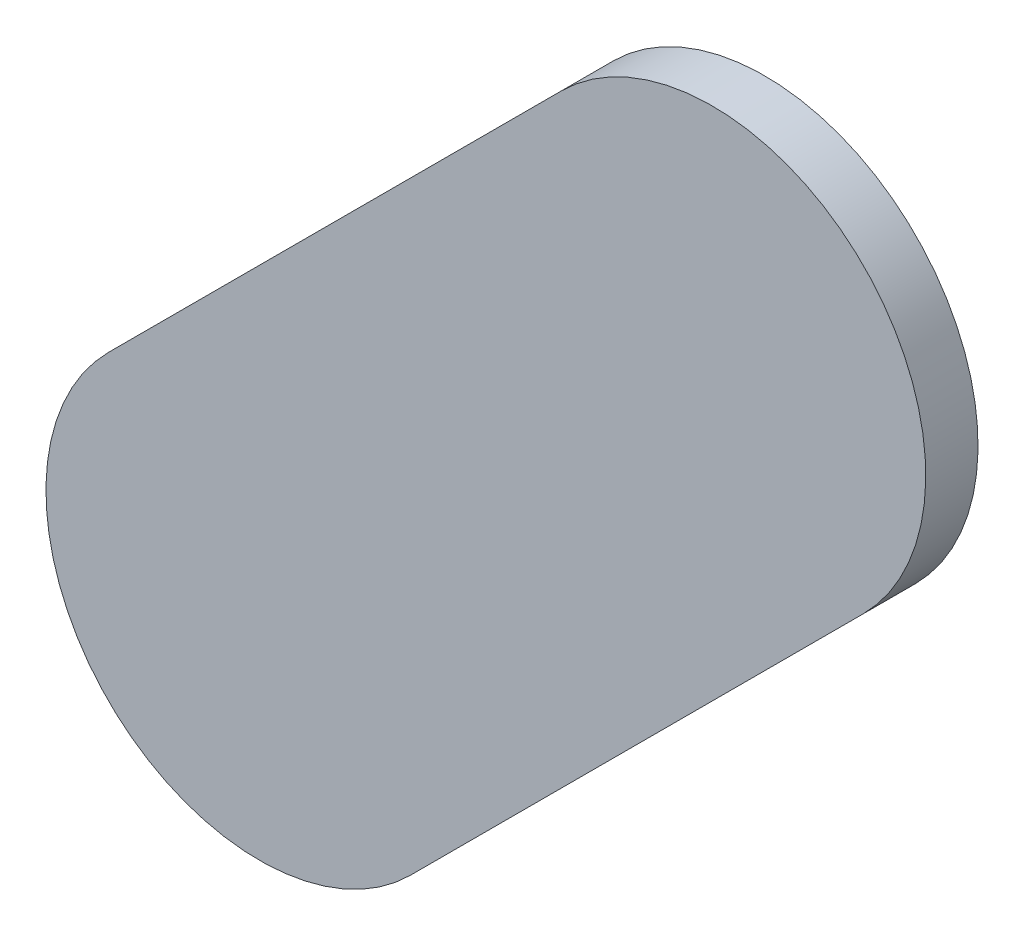
ISO-10303-21;
HEADER;
FILE_DESCRIPTION(('STEP AP214'),'2;1');
FILE_NAME('part.step','',(''),(''),'','','');
FILE_SCHEMA(('AUTOMOTIVE_DESIGN { 1 0 10303 214 1 1 1 1 }'));
ENDSEC;
DATA;
#1=APPLICATION_CONTEXT('core data for automotive mechanical design processes');
#2=APPLICATION_PROTOCOL_DEFINITION('international standard','automotive_design',2000,#1);
#3=PRODUCT_CONTEXT('',#1,'mechanical');
#4=PRODUCT('Part','Part','',(#3));
#5=PRODUCT_RELATED_PRODUCT_CATEGORY('part','',(#4));
#6=PRODUCT_DEFINITION_FORMATION('','',#4);
#7=PRODUCT_DEFINITION_CONTEXT('part definition',#1,'design');
#8=PRODUCT_DEFINITION('design','',#6,#7);
#9=PRODUCT_DEFINITION_SHAPE('','',#8);
#10=(LENGTH_UNIT() NAMED_UNIT(*) SI_UNIT(.MILLI.,.METRE.));
#11=(NAMED_UNIT(*) PLANE_ANGLE_UNIT() SI_UNIT($,.RADIAN.));
#12=(NAMED_UNIT(*) SI_UNIT($,.STERADIAN.) SOLID_ANGLE_UNIT());
#13=UNCERTAINTY_MEASURE_WITH_UNIT(LENGTH_MEASURE(1.E-05),#10,'distance_accuracy_value','');
#14=(GEOMETRIC_REPRESENTATION_CONTEXT(3) GLOBAL_UNCERTAINTY_ASSIGNED_CONTEXT((#13)) GLOBAL_UNIT_ASSIGNED_CONTEXT((#10,
#11,#12)) REPRESENTATION_CONTEXT('',''));
#15=CARTESIAN_POINT('',(0.,0.,0.));
#16=DIRECTION('',(0.,0.,1.));
#17=DIRECTION('',(1.,0.,0.));
#18=AXIS2_PLACEMENT_3D('',#15,#16,#17);
#19=CARTESIAN_POINT('',(5.77664475598,8.031518644531,0.79916));
#20=DIRECTION('',(0.,0.,1.));
#21=DIRECTION('',(1.,0.,0.));
#22=AXIS2_PLACEMENT_3D('',#19,#20,#21);
#23=PLANE('',#22);
#24=CARTESIAN_POINT('',(5.628152,7.883026,0.79916));
#25=DIRECTION('',(0.,0.,1.));
#26=DIRECTION('',(1.,0.,0.));
#27=AXIS2_PLACEMENT_3D('',#24,#25,#26);
#28=CIRCLE('',#27,0.139999667);
#29=CARTESIAN_POINT('',(5.72714731612217,7.78403131612202,0.79916));
#30=VERTEX_POINT('',#29);
#31=CARTESIAN_POINT('',(5.52915740491727,7.98202083271486,0.79916));
#32=VERTEX_POINT('',#31);
#33=EDGE_CURVE('E20',#30,#32,#28,.F.);
#34=ORIENTED_EDGE('',*,*,#33,.F.);
#35=DIRECTION('',(-0.707106660628037,-0.707106901745037,0.));
#36=VECTOR('',#35,1.);
#37=CARTESIAN_POINT('',(6.024131949366,8.081016050635,0.79916));
#38=LINE('',#37,#36);
#39=CARTESIAN_POINT('',(6.02413212430482,8.08101622557388,0.79916));
#40=VERTEX_POINT('',#39);
#41=EDGE_CURVE('E65',#30,#40,#38,.F.);
#42=ORIENTED_EDGE('',*,*,#41,.T.);
#43=CARTESIAN_POINT('',(5.925137,8.180011101268,0.79916));
#44=DIRECTION('',(0.,0.,1.));
#45=DIRECTION('',(1.,0.,0.));
#46=AXIS2_PLACEMENT_3D('',#43,#44,#45);
#47=CIRCLE('',#46,0.14);
#48=CARTESIAN_POINT('',(5.82614197763338,8.27900597763353,0.79916));
#49=VERTEX_POINT('',#48);
#50=EDGE_CURVE('E57',#49,#40,#47,.F.);
#51=ORIENTED_EDGE('',*,*,#50,.F.);
#52=DIRECTION('',(0.707106099992719,0.707107462379719,0.));
#53=VECTOR('',#52,1.);
#54=CARTESIAN_POINT('',(5.5291576191,7.982021046898,0.79916));
#55=LINE('',#54,#53);
#56=EDGE_CURVE('E64',#49,#32,#55,.F.);
#57=ORIENTED_EDGE('',*,*,#56,.T.);
#58=EDGE_LOOP('',(#34,#42,#51,#57));
#59=FACE_BOUND('',#58,.T.);
#60=ADVANCED_FACE('F17',(#59),#23,.T.);
#61=CARTESIAN_POINT('',(6.024131949366,8.081016050635,0.76487));
#62=DIRECTION('',(-0.707106901745037,0.707106660628037,0.));
#63=DIRECTION('',(-0.707106660628037,-0.707106901745037,0.));
#64=AXIS2_PLACEMENT_3D('',#61,#62,#63);
#65=PLANE('',#64);
#66=DIRECTION('',(0.,0.,1.));
#67=VECTOR('',#66,1.);
#68=CARTESIAN_POINT('',(5.7271473330001,7.7840313329999,0.76487));
#69=LINE('',#68,#67);
#70=CARTESIAN_POINT('',(5.72714731612214,7.78403131612203,0.76487));
#71=VERTEX_POINT('',#70);
#72=EDGE_CURVE('E68',#71,#30,#69,.T.);
#73=ORIENTED_EDGE('',*,*,#72,.F.);
#74=DIRECTION('',(-0.707106660628131,-0.707106901744943,0.));
#75=VECTOR('',#74,1.);
#76=CARTESIAN_POINT('',(6.024131949366,8.081016050635,0.76487));
#77=LINE('',#76,#75);
#78=CARTESIAN_POINT('',(6.02413212430481,8.08101622557387,0.76487));
#79=VERTEX_POINT('',#78);
#80=EDGE_CURVE('E72',#79,#71,#77,.T.);
#81=ORIENTED_EDGE('',*,*,#80,.F.);
#82=DIRECTION('',(0.,0.,1.));
#83=VECTOR('',#82,1.);
#84=CARTESIAN_POINT('',(6.024131949366,8.081016050635,0.76487));
#85=LINE('',#84,#83);
#86=EDGE_CURVE('E60',#40,#79,#85,.F.);
#87=ORIENTED_EDGE('',*,*,#86,.F.);
#88=ORIENTED_EDGE('',*,*,#41,.F.);
#89=EDGE_LOOP('',(#73,#81,#87,#88));
#90=FACE_BOUND('',#89,.T.);
#91=ADVANCED_FACE('F70',(#90),#65,.F.);
#92=CARTESIAN_POINT('',(5.628152,7.883026,0.76487));
#93=DIRECTION('',(0.,0.,1.));
#94=DIRECTION('',(1.,0.,0.));
#95=AXIS2_PLACEMENT_3D('',#92,#93,#94);
#96=CYLINDRICAL_SURFACE('',#95,0.139999667);
#97=DIRECTION('',(0.,0.,1.));
#98=VECTOR('',#97,1.);
#99=CARTESIAN_POINT('',(5.5291576191,7.982021046898,0.76487));
#100=LINE('',#99,#98);
#101=CARTESIAN_POINT('',(5.52915740491729,7.98202083271488,0.76487));
#102=VERTEX_POINT('',#101);
#103=EDGE_CURVE('E77',#32,#102,#100,.F.);
#104=ORIENTED_EDGE('',*,*,#103,.T.);
#105=CARTESIAN_POINT('',(5.628152333,7.883026231732,0.76487));
#106=DIRECTION('',(0.,0.,1.));
#107=DIRECTION('',(1.,0.,0.));
#108=AXIS2_PLACEMENT_3D('',#105,#106,#107);
#109=CIRCLE('',#108,0.14);
#110=EDGE_CURVE('E26',#71,#102,#109,.F.);
#111=ORIENTED_EDGE('',*,*,#110,.F.);
#112=ORIENTED_EDGE('',*,*,#72,.T.);
#113=ORIENTED_EDGE('',*,*,#33,.T.);
#114=EDGE_LOOP('',(#104,#111,#112,#113));
#115=FACE_BOUND('',#114,.T.);
#116=ADVANCED_FACE('F88',(#115),#96,.T.);
#117=CARTESIAN_POINT('',(5.5291576191,7.982021046898,0.76487));
#118=DIRECTION('',(0.707107462379719,-0.707106099992719,0.));
#119=DIRECTION('',(0.707106099992719,0.707107462379719,0.));
#120=AXIS2_PLACEMENT_3D('',#117,#118,#119);
#121=PLANE('',#120);
#122=DIRECTION('',(0.,0.,1.));
#123=VECTOR('',#122,1.);
#124=CARTESIAN_POINT('',(5.8261419999999,8.2790060000001,0.76487));
#125=LINE('',#124,#123);
#126=CARTESIAN_POINT('',(5.82614197763344,8.2790059776335,0.76487));
#127=VERTEX_POINT('',#126);
#128=EDGE_CURVE('E62',#127,#49,#125,.T.);
#129=ORIENTED_EDGE('',*,*,#128,.F.);
#130=DIRECTION('',(0.707106099992947,0.707107462379492,0.));
#131=VECTOR('',#130,1.);
#132=CARTESIAN_POINT('',(5.5291576191,7.982021046898,0.76487));
#133=LINE('',#132,#131);
#134=EDGE_CURVE('E11',#102,#127,#133,.T.);
#135=ORIENTED_EDGE('',*,*,#134,.F.);
#136=ORIENTED_EDGE('',*,*,#103,.F.);
#137=ORIENTED_EDGE('',*,*,#56,.F.);
#138=EDGE_LOOP('',(#129,#135,#136,#137));
#139=FACE_BOUND('',#138,.T.);
#140=ADVANCED_FACE('F96',(#139),#121,.F.);
#141=CARTESIAN_POINT('',(5.925137,8.180011101268,0.76487));
#142=DIRECTION('',(0.,0.,1.));
#143=DIRECTION('',(1.,0.,0.));
#144=AXIS2_PLACEMENT_3D('',#141,#142,#143);
#145=CYLINDRICAL_SURFACE('',#144,0.14);
#146=CARTESIAN_POINT('',(5.925137333,8.180011333,0.76487));
#147=DIRECTION('',(0.,0.,1.));
#148=DIRECTION('',(1.,0.,0.));
#149=AXIS2_PLACEMENT_3D('',#146,#147,#148);
#150=CIRCLE('',#149,0.14);
#151=EDGE_CURVE('E35',#127,#79,#150,.F.);
#152=ORIENTED_EDGE('',*,*,#151,.F.);
#153=ORIENTED_EDGE('',*,*,#128,.T.);
#154=ORIENTED_EDGE('',*,*,#50,.T.);
#155=ORIENTED_EDGE('',*,*,#86,.T.);
#156=EDGE_LOOP('',(#152,#153,#154,#155));
#157=FACE_BOUND('',#156,.T.);
#158=ADVANCED_FACE('F58',(#157),#145,.T.);
#159=CARTESIAN_POINT('',(5.77664475598,8.031518644531,0.76487));
#160=DIRECTION('',(0.,0.,-1.));
#161=DIRECTION('',(-1.,0.,0.));
#162=AXIS2_PLACEMENT_3D('',#159,#160,#161);
#163=PLANE('',#162);
#164=ORIENTED_EDGE('',*,*,#134,.T.);
#165=ORIENTED_EDGE('',*,*,#151,.T.);
#166=ORIENTED_EDGE('',*,*,#80,.T.);
#167=ORIENTED_EDGE('',*,*,#110,.T.);
#168=EDGE_LOOP('',(#164,#165,#166,#167));
#169=FACE_BOUND('',#168,.T.);
#170=ADVANCED_FACE('F89',(#169),#163,.T.);
#171=CLOSED_SHELL('',(#60,#91,#116,#140,#158,#170));
#172=MANIFOLD_SOLID_BREP('B1',#171);
#173=ADVANCED_BREP_SHAPE_REPRESENTATION('',(#18,#172),#14);
#174=SHAPE_DEFINITION_REPRESENTATION(#9,#173);
ENDSEC;
END-ISO-10303-21;
